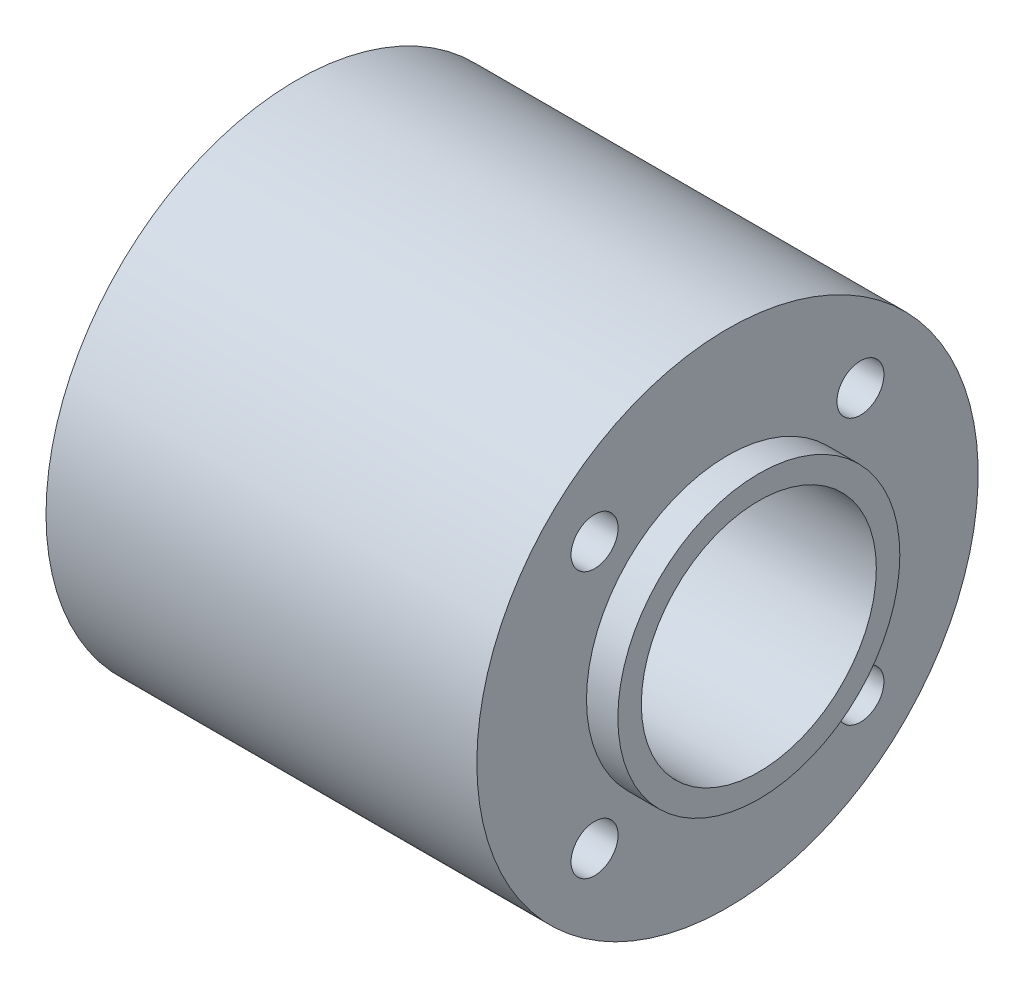
ISO-10303-21;
HEADER;
FILE_DESCRIPTION(('STEP AP214'),'2;1');
FILE_NAME('part.step','',(''),(''),'','','');
FILE_SCHEMA(('AUTOMOTIVE_DESIGN { 1 0 10303 214 1 1 1 1 }'));
ENDSEC;
DATA;
#1=APPLICATION_CONTEXT('core data for automotive mechanical design processes');
#2=APPLICATION_PROTOCOL_DEFINITION('international standard','automotive_design',2000,#1);
#3=PRODUCT_CONTEXT('',#1,'mechanical');
#4=PRODUCT('Part','Part','',(#3));
#5=PRODUCT_RELATED_PRODUCT_CATEGORY('part','',(#4));
#6=PRODUCT_DEFINITION_FORMATION('','',#4);
#7=PRODUCT_DEFINITION_CONTEXT('part definition',#1,'design');
#8=PRODUCT_DEFINITION('design','',#6,#7);
#9=PRODUCT_DEFINITION_SHAPE('','',#8);
#10=(LENGTH_UNIT() NAMED_UNIT(*) SI_UNIT(.MILLI.,.METRE.));
#11=(NAMED_UNIT(*) PLANE_ANGLE_UNIT() SI_UNIT($,.RADIAN.));
#12=(NAMED_UNIT(*) SI_UNIT($,.STERADIAN.) SOLID_ANGLE_UNIT());
#13=UNCERTAINTY_MEASURE_WITH_UNIT(LENGTH_MEASURE(1.E-05),#10,'distance_accuracy_value','');
#14=(GEOMETRIC_REPRESENTATION_CONTEXT(3) GLOBAL_UNCERTAINTY_ASSIGNED_CONTEXT((#13)) GLOBAL_UNIT_ASSIGNED_CONTEXT((#10,
#11,#12)) REPRESENTATION_CONTEXT('',''));
#15=CARTESIAN_POINT('',(0.,0.,0.));
#16=DIRECTION('',(0.,0.,1.));
#17=DIRECTION('',(1.,0.,0.));
#18=AXIS2_PLACEMENT_3D('',#15,#16,#17);
#19=CARTESIAN_POINT('',(-11.025,0.,0.));
#20=DIRECTION('',(-1.,0.,0.));
#21=DIRECTION('',(0.,0.,1.));
#22=AXIS2_PLACEMENT_3D('',#19,#20,#21);
#23=CYLINDRICAL_SURFACE('',#22,12.75);
#24=CARTESIAN_POINT('',(42.525,0.,0.));
#25=DIRECTION('',(-1.,0.,0.));
#26=DIRECTION('',(0.,0.,1.));
#27=AXIS2_PLACEMENT_3D('',#24,#25,#26);
#28=CIRCLE('',#27,12.75);
#29=CARTESIAN_POINT('',(42.525,0.,12.75));
#30=VERTEX_POINT('',#29);
#31=EDGE_CURVE('E52',#30,#30,#28,.T.);
#32=ORIENTED_EDGE('',*,*,#31,.F.);
#33=EDGE_LOOP('',(#32));
#34=FACE_BOUND('',#33,.T.);
#35=CARTESIAN_POINT('',(-11.025,0.,0.));
#36=DIRECTION('',(-1.,0.,0.));
#37=DIRECTION('',(0.,0.,1.));
#38=AXIS2_PLACEMENT_3D('',#35,#36,#37);
#39=CIRCLE('',#38,12.75);
#40=CARTESIAN_POINT('',(-11.025,0.,12.75));
#41=VERTEX_POINT('',#40);
#42=EDGE_CURVE('E10',#41,#41,#39,.T.);
#43=ORIENTED_EDGE('',*,*,#42,.T.);
#44=EDGE_LOOP('',(#43));
#45=FACE_BOUND('',#44,.T.);
#46=ADVANCED_FACE('F33',(#34,#45),#23,.F.);
#47=CARTESIAN_POINT('',(-11.025,12.75,0.));
#48=DIRECTION('',(1.,0.,0.));
#49=DIRECTION('',(0.,0.,-1.));
#50=AXIS2_PLACEMENT_3D('',#47,#48,#49);
#51=PLANE('',#50);
#52=ORIENTED_EDGE('',*,*,#42,.F.);
#53=EDGE_LOOP('',(#52));
#54=FACE_BOUND('',#53,.T.);
#55=CARTESIAN_POINT('',(-11.025,0.,0.));
#56=DIRECTION('',(-1.,0.,0.));
#57=DIRECTION('',(0.,0.,1.));
#58=AXIS2_PLACEMENT_3D('',#55,#56,#57);
#59=CIRCLE('',#58,15.3);
#60=CARTESIAN_POINT('',(-11.025,0.,15.3));
#61=VERTEX_POINT('',#60);
#62=EDGE_CURVE('E40',#61,#61,#59,.T.);
#63=ORIENTED_EDGE('',*,*,#62,.T.);
#64=EDGE_LOOP('',(#63));
#65=FACE_BOUND('',#64,.T.);
#66=ADVANCED_FACE('F123',(#54,#65),#51,.F.);
#67=CARTESIAN_POINT('',(-11.025,0.,0.));
#68=DIRECTION('',(-1.,0.,0.));
#69=DIRECTION('',(0.,0.,1.));
#70=AXIS2_PLACEMENT_3D('',#67,#68,#69);
#71=CYLINDRICAL_SURFACE('',#70,15.3);
#72=ORIENTED_EDGE('',*,*,#62,.F.);
#73=EDGE_LOOP('',(#72));
#74=FACE_BOUND('',#73,.T.);
#75=CARTESIAN_POINT('',(-7.625,0.,0.));
#76=DIRECTION('',(-1.,0.,0.));
#77=DIRECTION('',(0.,0.,1.));
#78=AXIS2_PLACEMENT_3D('',#75,#76,#77);
#79=CIRCLE('',#78,15.3);
#80=CARTESIAN_POINT('',(-7.625,0.,15.3));
#81=VERTEX_POINT('',#80);
#82=EDGE_CURVE('E45',#81,#81,#79,.T.);
#83=ORIENTED_EDGE('',*,*,#82,.T.);
#84=EDGE_LOOP('',(#83));
#85=FACE_BOUND('',#84,.T.);
#86=ADVANCED_FACE('F88',(#74,#85),#71,.T.);
#87=CARTESIAN_POINT('',(-7.625,15.3,0.));
#88=DIRECTION('',(1.,0.,0.));
#89=DIRECTION('',(0.,0.,-1.));
#90=AXIS2_PLACEMENT_3D('',#87,#88,#89);
#91=PLANE('',#90);
#92=CARTESIAN_POINT('',(-7.625,14.4249783362055,-14.4249783362056));
#93=DIRECTION('',(-1.,0.,0.));
#94=DIRECTION('',(0.,1.,0.));
#95=AXIS2_PLACEMENT_3D('',#92,#93,#94);
#96=CIRCLE('',#95,2.55);
#97=CARTESIAN_POINT('',(-7.625,16.9749783362055,-14.4249783362056));
#98=VERTEX_POINT('',#97);
#99=EDGE_CURVE('E57',#98,#98,#96,.T.);
#100=ORIENTED_EDGE('',*,*,#99,.F.);
#101=EDGE_LOOP('',(#100));
#102=FACE_BOUND('',#101,.T.);
#103=CARTESIAN_POINT('',(-7.625,-14.4249783362055,-14.4249783362056));
#104=DIRECTION('',(-1.,0.,0.));
#105=DIRECTION('',(0.,0.,-1.));
#106=AXIS2_PLACEMENT_3D('',#103,#104,#105);
#107=CIRCLE('',#106,2.55);
#108=CARTESIAN_POINT('',(-7.625,-14.4249783362055,-16.9749783362056));
#109=VERTEX_POINT('',#108);
#110=EDGE_CURVE('E153',#109,#109,#107,.T.);
#111=ORIENTED_EDGE('',*,*,#110,.F.);
#112=EDGE_LOOP('',(#111));
#113=FACE_BOUND('',#112,.T.);
#114=CARTESIAN_POINT('',(-7.625,-14.4249783362054,14.4249783362057));
#115=DIRECTION('',(-1.,0.,0.));
#116=DIRECTION('',(0.,-1.,0.));
#117=AXIS2_PLACEMENT_3D('',#114,#115,#116);
#118=CIRCLE('',#117,2.55);
#119=CARTESIAN_POINT('',(-7.625,-16.9749783362054,14.4249783362057));
#120=VERTEX_POINT('',#119);
#121=EDGE_CURVE('E70',#120,#120,#118,.T.);
#122=ORIENTED_EDGE('',*,*,#121,.F.);
#123=EDGE_LOOP('',(#122));
#124=FACE_BOUND('',#123,.T.);
#125=CARTESIAN_POINT('',(-7.625,14.4249783362055,14.4249783362056));
#126=DIRECTION('',(-1.,0.,0.));
#127=DIRECTION('',(0.,0.,1.));
#128=AXIS2_PLACEMENT_3D('',#125,#126,#127);
#129=CIRCLE('',#128,2.55);
#130=CARTESIAN_POINT('',(-7.625,14.4249783362055,16.9749783362056));
#131=VERTEX_POINT('',#130);
#132=EDGE_CURVE('E53',#131,#131,#129,.T.);
#133=ORIENTED_EDGE('',*,*,#132,.F.);
#134=EDGE_LOOP('',(#133));
#135=FACE_BOUND('',#134,.T.);
#136=ORIENTED_EDGE('',*,*,#82,.F.);
#137=EDGE_LOOP('',(#136));
#138=FACE_BOUND('',#137,.T.);
#139=CARTESIAN_POINT('',(-7.625,0.,0.));
#140=DIRECTION('',(-1.,0.,0.));
#141=DIRECTION('',(0.,0.,1.));
#142=AXIS2_PLACEMENT_3D('',#139,#140,#141);
#143=CIRCLE('',#142,27.2);
#144=CARTESIAN_POINT('',(-7.625,0.,27.2));
#145=VERTEX_POINT('',#144);
#146=EDGE_CURVE('E83',#145,#145,#143,.T.);
#147=ORIENTED_EDGE('',*,*,#146,.T.);
#148=EDGE_LOOP('',(#147));
#149=FACE_BOUND('',#148,.T.);
#150=ADVANCED_FACE('F90',(#102,#113,#124,#135,#138,#149),#91,.F.);
#151=CARTESIAN_POINT('',(-11.025,0.,0.));
#152=DIRECTION('',(-1.,0.,0.));
#153=DIRECTION('',(0.,0.,1.));
#154=AXIS2_PLACEMENT_3D('',#151,#152,#153);
#155=CYLINDRICAL_SURFACE('',#154,27.2);
#156=ORIENTED_EDGE('',*,*,#146,.F.);
#157=EDGE_LOOP('',(#156));
#158=FACE_BOUND('',#157,.T.);
#159=CARTESIAN_POINT('',(39.125,0.,0.));
#160=DIRECTION('',(-1.,0.,0.));
#161=DIRECTION('',(0.,0.,1.));
#162=AXIS2_PLACEMENT_3D('',#159,#160,#161);
#163=CIRCLE('',#162,27.2);
#164=CARTESIAN_POINT('',(39.125,0.,27.2));
#165=VERTEX_POINT('',#164);
#166=EDGE_CURVE('E80',#165,#165,#163,.T.);
#167=ORIENTED_EDGE('',*,*,#166,.T.);
#168=EDGE_LOOP('',(#167));
#169=FACE_BOUND('',#168,.T.);
#170=ADVANCED_FACE('F93',(#158,#169),#155,.T.);
#171=CARTESIAN_POINT('',(39.125,27.2,0.));
#172=DIRECTION('',(-1.,0.,0.));
#173=DIRECTION('',(0.,0.,1.));
#174=AXIS2_PLACEMENT_3D('',#171,#172,#173);
#175=PLANE('',#174);
#176=CARTESIAN_POINT('',(39.125,14.4249783362055,-14.4249783362056));
#177=DIRECTION('',(-1.,0.,0.));
#178=DIRECTION('',(0.,0.,1.));
#179=AXIS2_PLACEMENT_3D('',#176,#177,#178);
#180=CIRCLE('',#179,2.55);
#181=CARTESIAN_POINT('',(39.125,14.4249783362055,-11.8749783362056));
#182=VERTEX_POINT('',#181);
#183=EDGE_CURVE('E36',#182,#182,#180,.T.);
#184=ORIENTED_EDGE('',*,*,#183,.T.);
#185=EDGE_LOOP('',(#184));
#186=FACE_BOUND('',#185,.T.);
#187=CARTESIAN_POINT('',(39.125,-14.4249783362055,-14.4249783362056));
#188=DIRECTION('',(-1.,0.,0.));
#189=DIRECTION('',(0.,0.,1.));
#190=AXIS2_PLACEMENT_3D('',#187,#188,#189);
#191=CIRCLE('',#190,2.55);
#192=CARTESIAN_POINT('',(39.125,-14.4249783362055,-11.8749783362056));
#193=VERTEX_POINT('',#192);
#194=EDGE_CURVE('E56',#193,#193,#191,.T.);
#195=ORIENTED_EDGE('',*,*,#194,.T.);
#196=EDGE_LOOP('',(#195));
#197=FACE_BOUND('',#196,.T.);
#198=CARTESIAN_POINT('',(39.125,-14.4249783362054,14.4249783362057));
#199=DIRECTION('',(-1.,0.,0.));
#200=DIRECTION('',(0.,0.,1.));
#201=AXIS2_PLACEMENT_3D('',#198,#199,#200);
#202=CIRCLE('',#201,2.55);
#203=CARTESIAN_POINT('',(39.125,-14.4249783362054,16.9749783362057));
#204=VERTEX_POINT('',#203);
#205=EDGE_CURVE('E54',#204,#204,#202,.T.);
#206=ORIENTED_EDGE('',*,*,#205,.T.);
#207=EDGE_LOOP('',(#206));
#208=FACE_BOUND('',#207,.T.);
#209=CARTESIAN_POINT('',(39.125,14.4249783362055,14.4249783362056));
#210=DIRECTION('',(-1.,0.,0.));
#211=DIRECTION('',(0.,0.,1.));
#212=AXIS2_PLACEMENT_3D('',#209,#210,#211);
#213=CIRCLE('',#212,2.55);
#214=CARTESIAN_POINT('',(39.125,14.4249783362055,16.9749783362056));
#215=VERTEX_POINT('',#214);
#216=EDGE_CURVE('E49',#215,#215,#213,.T.);
#217=ORIENTED_EDGE('',*,*,#216,.T.);
#218=EDGE_LOOP('',(#217));
#219=FACE_BOUND('',#218,.T.);
#220=ORIENTED_EDGE('',*,*,#166,.F.);
#221=EDGE_LOOP('',(#220));
#222=FACE_BOUND('',#221,.T.);
#223=CARTESIAN_POINT('',(39.125,0.,0.));
#224=DIRECTION('',(-1.,0.,0.));
#225=DIRECTION('',(0.,0.,1.));
#226=AXIS2_PLACEMENT_3D('',#223,#224,#225);
#227=CIRCLE('',#226,15.3);
#228=CARTESIAN_POINT('',(39.125,0.,15.3));
#229=VERTEX_POINT('',#228);
#230=EDGE_CURVE('E77',#229,#229,#227,.T.);
#231=ORIENTED_EDGE('',*,*,#230,.T.);
#232=EDGE_LOOP('',(#231));
#233=FACE_BOUND('',#232,.T.);
#234=ADVANCED_FACE('F100',(#186,#197,#208,#219,#222,#233),#175,.F.);
#235=CARTESIAN_POINT('',(-11.025,0.,0.));
#236=DIRECTION('',(-1.,0.,0.));
#237=DIRECTION('',(0.,0.,1.));
#238=AXIS2_PLACEMENT_3D('',#235,#236,#237);
#239=CYLINDRICAL_SURFACE('',#238,15.3);
#240=ORIENTED_EDGE('',*,*,#230,.F.);
#241=EDGE_LOOP('',(#240));
#242=FACE_BOUND('',#241,.T.);
#243=CARTESIAN_POINT('',(42.525,0.,0.));
#244=DIRECTION('',(-1.,0.,0.));
#245=DIRECTION('',(0.,0.,1.));
#246=AXIS2_PLACEMENT_3D('',#243,#244,#245);
#247=CIRCLE('',#246,15.3);
#248=CARTESIAN_POINT('',(42.525,0.,15.3));
#249=VERTEX_POINT('',#248);
#250=EDGE_CURVE('E74',#249,#249,#247,.T.);
#251=ORIENTED_EDGE('',*,*,#250,.T.);
#252=EDGE_LOOP('',(#251));
#253=FACE_BOUND('',#252,.T.);
#254=ADVANCED_FACE('F106',(#242,#253),#239,.T.);
#255=CARTESIAN_POINT('',(42.525,15.3,0.));
#256=DIRECTION('',(-1.,0.,0.));
#257=DIRECTION('',(0.,0.,1.));
#258=AXIS2_PLACEMENT_3D('',#255,#256,#257);
#259=PLANE('',#258);
#260=ORIENTED_EDGE('',*,*,#250,.F.);
#261=EDGE_LOOP('',(#260));
#262=FACE_BOUND('',#261,.T.);
#263=ORIENTED_EDGE('',*,*,#31,.T.);
#264=EDGE_LOOP('',(#263));
#265=FACE_BOUND('',#264,.T.);
#266=ADVANCED_FACE('F112',(#262,#265),#259,.F.);
#267=CARTESIAN_POINT('',(42.525,14.4249783362055,14.4249783362056));
#268=DIRECTION('',(-1.,0.,0.));
#269=DIRECTION('',(0.,0.,1.));
#270=AXIS2_PLACEMENT_3D('',#267,#268,#269);
#271=CYLINDRICAL_SURFACE('',#270,2.55);
#272=ORIENTED_EDGE('',*,*,#132,.T.);
#273=EDGE_LOOP('',(#272));
#274=FACE_BOUND('',#273,.T.);
#275=ORIENTED_EDGE('',*,*,#216,.F.);
#276=EDGE_LOOP('',(#275));
#277=FACE_BOUND('',#276,.T.);
#278=ADVANCED_FACE('F118',(#274,#277),#271,.F.);
#279=CARTESIAN_POINT('',(42.525,-14.4249783362054,14.4249783362057));
#280=DIRECTION('',(-1.,0.,0.));
#281=DIRECTION('',(0.,0.,1.));
#282=AXIS2_PLACEMENT_3D('',#279,#280,#281);
#283=CYLINDRICAL_SURFACE('',#282,2.55);
#284=ORIENTED_EDGE('',*,*,#121,.T.);
#285=EDGE_LOOP('',(#284));
#286=FACE_BOUND('',#285,.T.);
#287=ORIENTED_EDGE('',*,*,#205,.F.);
#288=EDGE_LOOP('',(#287));
#289=FACE_BOUND('',#288,.T.);
#290=ADVANCED_FACE('F137',(#286,#289),#283,.F.);
#291=CARTESIAN_POINT('',(42.525,-14.4249783362055,-14.4249783362056));
#292=DIRECTION('',(-1.,0.,0.));
#293=DIRECTION('',(0.,0.,1.));
#294=AXIS2_PLACEMENT_3D('',#291,#292,#293);
#295=CYLINDRICAL_SURFACE('',#294,2.55);
#296=ORIENTED_EDGE('',*,*,#110,.T.);
#297=EDGE_LOOP('',(#296));
#298=FACE_BOUND('',#297,.T.);
#299=ORIENTED_EDGE('',*,*,#194,.F.);
#300=EDGE_LOOP('',(#299));
#301=FACE_BOUND('',#300,.T.);
#302=ADVANCED_FACE('F140',(#298,#301),#295,.F.);
#303=CARTESIAN_POINT('',(42.525,14.4249783362055,-14.4249783362056));
#304=DIRECTION('',(-1.,0.,0.));
#305=DIRECTION('',(0.,0.,1.));
#306=AXIS2_PLACEMENT_3D('',#303,#304,#305);
#307=CYLINDRICAL_SURFACE('',#306,2.55);
#308=ORIENTED_EDGE('',*,*,#99,.T.);
#309=EDGE_LOOP('',(#308));
#310=FACE_BOUND('',#309,.T.);
#311=ORIENTED_EDGE('',*,*,#183,.F.);
#312=EDGE_LOOP('',(#311));
#313=FACE_BOUND('',#312,.T.);
#314=ADVANCED_FACE('F144',(#310,#313),#307,.F.);
#315=CLOSED_SHELL('',(#46,#66,#86,#150,#170,#234,#254,#266,#278,#290,#302,#314));
#316=MANIFOLD_SOLID_BREP('B2',#315);
#317=ADVANCED_BREP_SHAPE_REPRESENTATION('',(#18,#316),#14);
#318=SHAPE_DEFINITION_REPRESENTATION(#9,#317);
ENDSEC;
END-ISO-10303-21;
